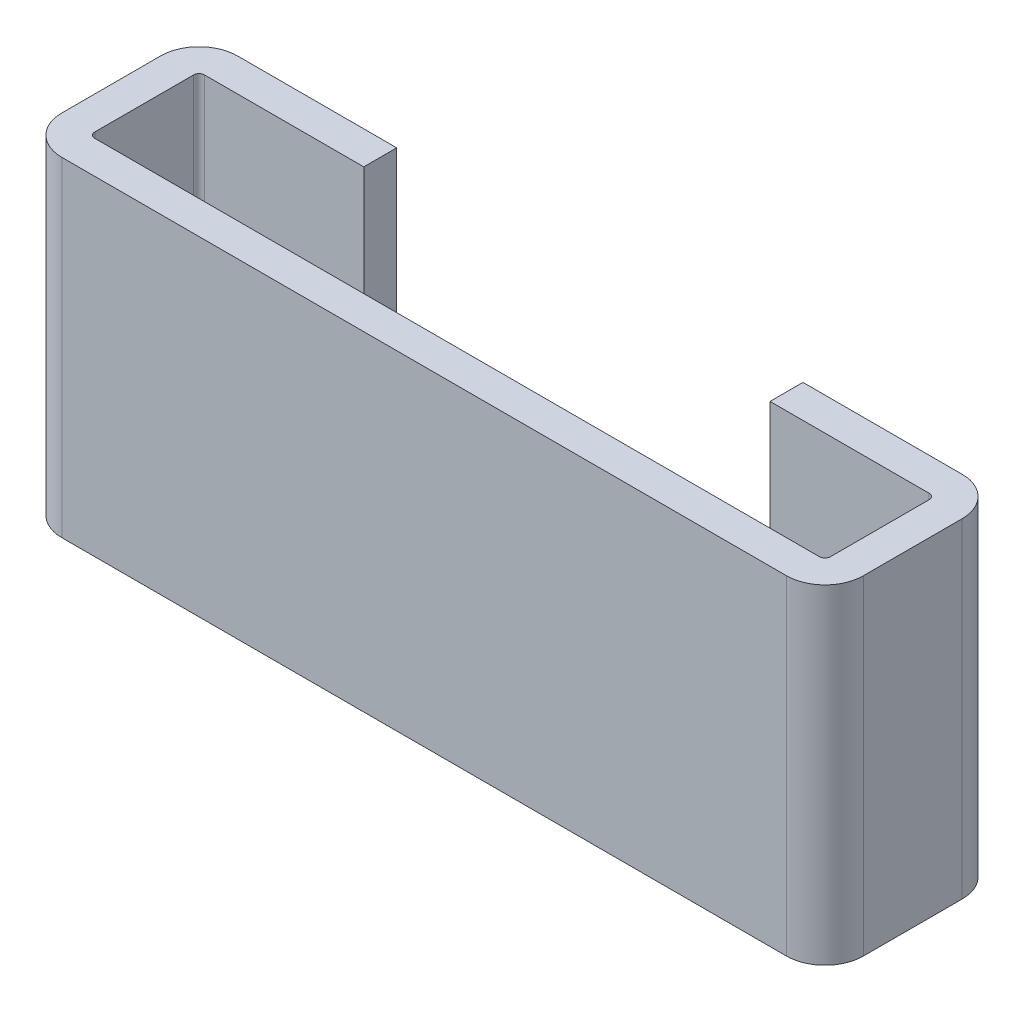
ISO-10303-21;
HEADER;
FILE_DESCRIPTION(('STEP AP214'),'2;1');
FILE_NAME('part.step','',(''),(''),'','','');
FILE_SCHEMA(('AUTOMOTIVE_DESIGN { 1 0 10303 214 1 1 1 1 }'));
ENDSEC;
DATA;
#1=APPLICATION_CONTEXT('core data for automotive mechanical design processes');
#2=APPLICATION_PROTOCOL_DEFINITION('international standard','automotive_design',2000,#1);
#3=PRODUCT_CONTEXT('',#1,'mechanical');
#4=PRODUCT('Part','Part','',(#3));
#5=PRODUCT_RELATED_PRODUCT_CATEGORY('part','',(#4));
#6=PRODUCT_DEFINITION_FORMATION('','',#4);
#7=PRODUCT_DEFINITION_CONTEXT('part definition',#1,'design');
#8=PRODUCT_DEFINITION('design','',#6,#7);
#9=PRODUCT_DEFINITION_SHAPE('','',#8);
#10=(LENGTH_UNIT() NAMED_UNIT(*) SI_UNIT(.MILLI.,.METRE.));
#11=(NAMED_UNIT(*) PLANE_ANGLE_UNIT() SI_UNIT($,.RADIAN.));
#12=(NAMED_UNIT(*) SI_UNIT($,.STERADIAN.) SOLID_ANGLE_UNIT());
#13=UNCERTAINTY_MEASURE_WITH_UNIT(LENGTH_MEASURE(1.E-05),#10,'distance_accuracy_value','');
#14=(GEOMETRIC_REPRESENTATION_CONTEXT(3) GLOBAL_UNCERTAINTY_ASSIGNED_CONTEXT((#13)) GLOBAL_UNIT_ASSIGNED_CONTEXT((#10,
#11,#12)) REPRESENTATION_CONTEXT('',''));
#15=CARTESIAN_POINT('',(0.,0.,0.));
#16=DIRECTION('',(0.,0.,1.));
#17=DIRECTION('',(1.,0.,0.));
#18=AXIS2_PLACEMENT_3D('',#15,#16,#17);
#19=CARTESIAN_POINT('',(1.85,1.5,-0.1));
#20=DIRECTION('',(1.,0.,0.));
#21=DIRECTION('',(0.,-1.,0.));
#22=AXIS2_PLACEMENT_3D('',#19,#20,#21);
#23=PLANE('',#22);
#24=DIRECTION('',(0.,1.,0.));
#25=VECTOR('',#24,1.);
#26=CARTESIAN_POINT('',(1.85,1.5,0.2));
#27=LINE('',#26,#25);
#28=CARTESIAN_POINT('',(1.85,-1.5,0.2));
#29=VERTEX_POINT('',#28);
#30=CARTESIAN_POINT('',(1.85,1.5,0.2));
#31=VERTEX_POINT('',#30);
#32=EDGE_CURVE('E11',#29,#31,#27,.T.);
#33=ORIENTED_EDGE('',*,*,#32,.T.);
#34=DIRECTION('',(0.,0.,-1.));
#35=VECTOR('',#34,1.);
#36=CARTESIAN_POINT('',(1.85,1.5,-0.1));
#37=LINE('',#36,#35);
#38=CARTESIAN_POINT('',(1.85,1.5,-0.1));
#39=VERTEX_POINT('',#38);
#40=EDGE_CURVE('E24',#31,#39,#37,.T.);
#41=ORIENTED_EDGE('',*,*,#40,.T.);
#42=DIRECTION('',(0.,-1.,0.));
#43=VECTOR('',#42,1.);
#44=CARTESIAN_POINT('',(1.85,1.5,-0.1));
#45=LINE('',#44,#43);
#46=CARTESIAN_POINT('',(1.85,-1.5,-0.1));
#47=VERTEX_POINT('',#46);
#48=EDGE_CURVE('E167',#39,#47,#45,.T.);
#49=ORIENTED_EDGE('',*,*,#48,.T.);
#50=DIRECTION('',(0.,0.,-1.));
#51=VECTOR('',#50,1.);
#52=CARTESIAN_POINT('',(1.85,-1.5,-0.1));
#53=LINE('',#52,#51);
#54=EDGE_CURVE('E267',#29,#47,#53,.T.);
#55=ORIENTED_EDGE('',*,*,#54,.F.);
#56=EDGE_LOOP('',(#33,#41,#49,#55));
#57=FACE_BOUND('',#56,.T.);
#58=ADVANCED_FACE('F17',(#57),#23,.F.);
#59=CARTESIAN_POINT('',(1.85,-1.5,-0.1));
#60=DIRECTION('',(0.,1.,0.));
#61=DIRECTION('',(1.,0.,0.));
#62=AXIS2_PLACEMENT_3D('',#59,#60,#61);
#63=PLANE('',#62);
#64=DIRECTION('',(1.,0.,0.));
#65=VECTOR('',#64,1.);
#66=CARTESIAN_POINT('',(1.85,-1.5,-0.1));
#67=LINE('',#66,#65);
#68=CARTESIAN_POINT('',(3.3,-1.5,-0.1));
#69=VERTEX_POINT('',#68);
#70=EDGE_CURVE('E265',#47,#69,#67,.T.);
#71=ORIENTED_EDGE('',*,*,#70,.T.);
#72=CARTESIAN_POINT('',(3.3,-1.5,0.25));
#73=DIRECTION('',(0.,-1.,0.));
#74=DIRECTION('',(-1.,0.,0.));
#75=AXIS2_PLACEMENT_3D('',#72,#73,#74);
#76=CIRCLE('',#75,0.35);
#77=CARTESIAN_POINT('',(3.65,-1.5,0.25));
#78=VERTEX_POINT('',#77);
#79=EDGE_CURVE('E172',#69,#78,#76,.T.);
#80=ORIENTED_EDGE('',*,*,#79,.T.);
#81=DIRECTION('',(0.,0.,1.));
#82=VECTOR('',#81,1.);
#83=CARTESIAN_POINT('',(3.65,-1.5,0.25));
#84=LINE('',#83,#82);
#85=CARTESIAN_POINT('',(3.65,-1.5,1.15));
#86=VERTEX_POINT('',#85);
#87=EDGE_CURVE('E262',#78,#86,#84,.T.);
#88=ORIENTED_EDGE('',*,*,#87,.T.);
#89=CARTESIAN_POINT('',(3.3,-1.5,1.15));
#90=DIRECTION('',(0.,-1.,0.));
#91=DIRECTION('',(0.,0.,-1.));
#92=AXIS2_PLACEMENT_3D('',#89,#90,#91);
#93=CIRCLE('',#92,0.35);
#94=CARTESIAN_POINT('',(3.3,-1.5,1.5));
#95=VERTEX_POINT('',#94);
#96=EDGE_CURVE('E260',#86,#95,#93,.T.);
#97=ORIENTED_EDGE('',*,*,#96,.T.);
#98=DIRECTION('',(-1.,0.,0.));
#99=VECTOR('',#98,1.);
#100=CARTESIAN_POINT('',(-3.3,-1.5,1.5));
#101=LINE('',#100,#99);
#102=CARTESIAN_POINT('',(-3.3,-1.5,1.5));
#103=VERTEX_POINT('',#102);
#104=EDGE_CURVE('E258',#95,#103,#101,.T.);
#105=ORIENTED_EDGE('',*,*,#104,.T.);
#106=CARTESIAN_POINT('',(-3.3,-1.5,1.15));
#107=DIRECTION('',(0.,-1.,0.));
#108=DIRECTION('',(0.,0.,-1.));
#109=AXIS2_PLACEMENT_3D('',#106,#107,#108);
#110=CIRCLE('',#109,0.35);
#111=CARTESIAN_POINT('',(-3.65,-1.5,1.15));
#112=VERTEX_POINT('',#111);
#113=EDGE_CURVE('E256',#103,#112,#110,.T.);
#114=ORIENTED_EDGE('',*,*,#113,.T.);
#115=DIRECTION('',(0.,0.,-1.));
#116=VECTOR('',#115,1.);
#117=CARTESIAN_POINT('',(-3.65,-1.5,1.15));
#118=LINE('',#117,#116);
#119=CARTESIAN_POINT('',(-3.65,-1.5,0.25));
#120=VERTEX_POINT('',#119);
#121=EDGE_CURVE('E254',#112,#120,#118,.T.);
#122=ORIENTED_EDGE('',*,*,#121,.T.);
#123=CARTESIAN_POINT('',(-3.3,-1.5,0.25));
#124=DIRECTION('',(0.,-1.,0.));
#125=DIRECTION('',(1.,0.,0.));
#126=AXIS2_PLACEMENT_3D('',#123,#124,#125);
#127=CIRCLE('',#126,0.35);
#128=CARTESIAN_POINT('',(-3.3,-1.5,-0.1));
#129=VERTEX_POINT('',#128);
#130=EDGE_CURVE('E252',#120,#129,#127,.T.);
#131=ORIENTED_EDGE('',*,*,#130,.T.);
#132=DIRECTION('',(1.,0.,0.));
#133=VECTOR('',#132,1.);
#134=CARTESIAN_POINT('',(-3.3,-1.5,-0.1));
#135=LINE('',#134,#133);
#136=CARTESIAN_POINT('',(-1.85,-1.5,-0.1));
#137=VERTEX_POINT('',#136);
#138=EDGE_CURVE('E250',#129,#137,#135,.T.);
#139=ORIENTED_EDGE('',*,*,#138,.T.);
#140=DIRECTION('',(0.,0.,-1.));
#141=VECTOR('',#140,1.);
#142=CARTESIAN_POINT('',(-1.85,-1.5,-0.1));
#143=LINE('',#142,#141);
#144=CARTESIAN_POINT('',(-1.85,-1.5,0.2));
#145=VERTEX_POINT('',#144);
#146=EDGE_CURVE('E247',#145,#137,#143,.T.);
#147=ORIENTED_EDGE('',*,*,#146,.F.);
#148=DIRECTION('',(-1.,0.,0.));
#149=VECTOR('',#148,1.);
#150=CARTESIAN_POINT('',(-3.3,-1.5,0.2));
#151=LINE('',#150,#149);
#152=CARTESIAN_POINT('',(-3.3,-1.5,0.2));
#153=VERTEX_POINT('',#152);
#154=EDGE_CURVE('E245',#145,#153,#151,.T.);
#155=ORIENTED_EDGE('',*,*,#154,.T.);
#156=CARTESIAN_POINT('',(-3.3,-1.5,0.25));
#157=DIRECTION('',(0.,-1.,0.));
#158=DIRECTION('',(1.,0.,0.));
#159=AXIS2_PLACEMENT_3D('',#156,#157,#158);
#160=CIRCLE('',#159,0.05);
#161=CARTESIAN_POINT('',(-3.35,-1.5,0.25));
#162=VERTEX_POINT('',#161);
#163=EDGE_CURVE('E242',#162,#153,#160,.T.);
#164=ORIENTED_EDGE('',*,*,#163,.F.);
#165=DIRECTION('',(0.,0.,1.));
#166=VECTOR('',#165,1.);
#167=CARTESIAN_POINT('',(-3.35,-1.5,1.15));
#168=LINE('',#167,#166);
#169=CARTESIAN_POINT('',(-3.35,-1.5,1.15));
#170=VERTEX_POINT('',#169);
#171=EDGE_CURVE('E240',#162,#170,#168,.T.);
#172=ORIENTED_EDGE('',*,*,#171,.T.);
#173=CARTESIAN_POINT('',(-3.3,-1.5,1.15));
#174=DIRECTION('',(0.,-1.,0.));
#175=DIRECTION('',(-1.,0.,0.));
#176=AXIS2_PLACEMENT_3D('',#173,#174,#175);
#177=CIRCLE('',#176,0.05);
#178=CARTESIAN_POINT('',(-3.3,-1.5,1.2));
#179=VERTEX_POINT('',#178);
#180=EDGE_CURVE('E237',#179,#170,#177,.T.);
#181=ORIENTED_EDGE('',*,*,#180,.F.);
#182=DIRECTION('',(1.,0.,0.));
#183=VECTOR('',#182,1.);
#184=CARTESIAN_POINT('',(-3.3,-1.5,1.2));
#185=LINE('',#184,#183);
#186=CARTESIAN_POINT('',(3.3,-1.5,1.2));
#187=VERTEX_POINT('',#186);
#188=EDGE_CURVE('E235',#179,#187,#185,.T.);
#189=ORIENTED_EDGE('',*,*,#188,.T.);
#190=CARTESIAN_POINT('',(3.3,-1.5,1.15));
#191=DIRECTION('',(0.,1.,0.));
#192=DIRECTION('',(0.,0.,1.));
#193=AXIS2_PLACEMENT_3D('',#190,#191,#192);
#194=CIRCLE('',#193,0.05);
#195=CARTESIAN_POINT('',(3.35,-1.5,1.15));
#196=VERTEX_POINT('',#195);
#197=EDGE_CURVE('E233',#187,#196,#194,.T.);
#198=ORIENTED_EDGE('',*,*,#197,.T.);
#199=DIRECTION('',(0.,0.,-1.));
#200=VECTOR('',#199,1.);
#201=CARTESIAN_POINT('',(3.35,-1.5,0.25));
#202=LINE('',#201,#200);
#203=CARTESIAN_POINT('',(3.35,-1.5,0.25));
#204=VERTEX_POINT('',#203);
#205=EDGE_CURVE('E231',#196,#204,#202,.T.);
#206=ORIENTED_EDGE('',*,*,#205,.T.);
#207=CARTESIAN_POINT('',(3.3,-1.5,0.25));
#208=DIRECTION('',(0.,1.,0.));
#209=DIRECTION('',(0.,0.,1.));
#210=AXIS2_PLACEMENT_3D('',#207,#208,#209);
#211=CIRCLE('',#210,0.05);
#212=CARTESIAN_POINT('',(3.3,-1.5,0.2));
#213=VERTEX_POINT('',#212);
#214=EDGE_CURVE('E229',#204,#213,#211,.T.);
#215=ORIENTED_EDGE('',*,*,#214,.T.);
#216=DIRECTION('',(-1.,0.,0.));
#217=VECTOR('',#216,1.);
#218=CARTESIAN_POINT('',(1.85,-1.5,0.2));
#219=LINE('',#218,#217);
#220=EDGE_CURVE('E226',#213,#29,#219,.T.);
#221=ORIENTED_EDGE('',*,*,#220,.T.);
#222=ORIENTED_EDGE('',*,*,#54,.T.);
#223=EDGE_LOOP('',(#71,#80,#88,#97,#105,#114,#122,#131,#139,#147,#155,#164,#172,#181,#189,#198,
#206,#215,#221,#222));
#224=FACE_BOUND('',#223,.T.);
#225=ADVANCED_FACE('F349',(#224),#63,.F.);
#226=CARTESIAN_POINT('',(-3.3,1.5,-0.1));
#227=DIRECTION('',(0.,1.,0.));
#228=DIRECTION('',(1.,0.,0.));
#229=AXIS2_PLACEMENT_3D('',#226,#227,#228);
#230=PLANE('',#229);
#231=DIRECTION('',(-1.,0.,0.));
#232=VECTOR('',#231,1.);
#233=CARTESIAN_POINT('',(1.85,1.5,0.2));
#234=LINE('',#233,#232);
#235=CARTESIAN_POINT('',(3.3,1.5,0.2));
#236=VERTEX_POINT('',#235);
#237=EDGE_CURVE('E224',#236,#31,#234,.T.);
#238=ORIENTED_EDGE('',*,*,#237,.F.);
#239=CARTESIAN_POINT('',(3.3,1.5,0.25));
#240=DIRECTION('',(0.,1.,0.));
#241=DIRECTION('',(0.,0.,1.));
#242=AXIS2_PLACEMENT_3D('',#239,#240,#241);
#243=CIRCLE('',#242,0.05);
#244=CARTESIAN_POINT('',(3.35,1.5,0.25));
#245=VERTEX_POINT('',#244);
#246=EDGE_CURVE('E221',#245,#236,#243,.T.);
#247=ORIENTED_EDGE('',*,*,#246,.F.);
#248=DIRECTION('',(0.,0.,-1.));
#249=VECTOR('',#248,1.);
#250=CARTESIAN_POINT('',(3.35,1.5,0.25));
#251=LINE('',#250,#249);
#252=CARTESIAN_POINT('',(3.35,1.5,1.15));
#253=VERTEX_POINT('',#252);
#254=EDGE_CURVE('E218',#253,#245,#251,.T.);
#255=ORIENTED_EDGE('',*,*,#254,.F.);
#256=CARTESIAN_POINT('',(3.3,1.5,1.15));
#257=DIRECTION('',(0.,1.,0.));
#258=DIRECTION('',(0.,0.,1.));
#259=AXIS2_PLACEMENT_3D('',#256,#257,#258);
#260=CIRCLE('',#259,0.05);
#261=CARTESIAN_POINT('',(3.3,1.5,1.2));
#262=VERTEX_POINT('',#261);
#263=EDGE_CURVE('E215',#262,#253,#260,.T.);
#264=ORIENTED_EDGE('',*,*,#263,.F.);
#265=DIRECTION('',(1.,0.,0.));
#266=VECTOR('',#265,1.);
#267=CARTESIAN_POINT('',(-3.3,1.5,1.2));
#268=LINE('',#267,#266);
#269=CARTESIAN_POINT('',(-3.3,1.5,1.2));
#270=VERTEX_POINT('',#269);
#271=EDGE_CURVE('E212',#270,#262,#268,.T.);
#272=ORIENTED_EDGE('',*,*,#271,.F.);
#273=CARTESIAN_POINT('',(-3.3,1.5,1.15));
#274=DIRECTION('',(0.,-1.,0.));
#275=DIRECTION('',(-1.,0.,0.));
#276=AXIS2_PLACEMENT_3D('',#273,#274,#275);
#277=CIRCLE('',#276,0.05);
#278=CARTESIAN_POINT('',(-3.35,1.5,1.15));
#279=VERTEX_POINT('',#278);
#280=EDGE_CURVE('E210',#270,#279,#277,.T.);
#281=ORIENTED_EDGE('',*,*,#280,.T.);
#282=DIRECTION('',(0.,0.,1.));
#283=VECTOR('',#282,1.);
#284=CARTESIAN_POINT('',(-3.35,1.5,1.15));
#285=LINE('',#284,#283);
#286=CARTESIAN_POINT('',(-3.35,1.5,0.25));
#287=VERTEX_POINT('',#286);
#288=EDGE_CURVE('E207',#287,#279,#285,.T.);
#289=ORIENTED_EDGE('',*,*,#288,.F.);
#290=CARTESIAN_POINT('',(-3.3,1.5,0.25));
#291=DIRECTION('',(0.,-1.,0.));
#292=DIRECTION('',(1.,0.,0.));
#293=AXIS2_PLACEMENT_3D('',#290,#291,#292);
#294=CIRCLE('',#293,0.05);
#295=CARTESIAN_POINT('',(-3.3,1.5,0.2));
#296=VERTEX_POINT('',#295);
#297=EDGE_CURVE('E205',#287,#296,#294,.T.);
#298=ORIENTED_EDGE('',*,*,#297,.T.);
#299=DIRECTION('',(-1.,0.,0.));
#300=VECTOR('',#299,1.);
#301=CARTESIAN_POINT('',(-3.3,1.5,0.2));
#302=LINE('',#301,#300);
#303=CARTESIAN_POINT('',(-1.85,1.5,0.2));
#304=VERTEX_POINT('',#303);
#305=EDGE_CURVE('E202',#304,#296,#302,.T.);
#306=ORIENTED_EDGE('',*,*,#305,.F.);
#307=DIRECTION('',(0.,0.,-1.));
#308=VECTOR('',#307,1.);
#309=CARTESIAN_POINT('',(-1.85,1.5,-0.1));
#310=LINE('',#309,#308);
#311=CARTESIAN_POINT('',(-1.85,1.5,-0.1));
#312=VERTEX_POINT('',#311);
#313=EDGE_CURVE('E200',#304,#312,#310,.T.);
#314=ORIENTED_EDGE('',*,*,#313,.T.);
#315=DIRECTION('',(1.,0.,0.));
#316=VECTOR('',#315,1.);
#317=CARTESIAN_POINT('',(-3.3,1.5,-0.1));
#318=LINE('',#317,#316);
#319=CARTESIAN_POINT('',(-3.3,1.5,-0.1));
#320=VERTEX_POINT('',#319);
#321=EDGE_CURVE('E197',#320,#312,#318,.T.);
#322=ORIENTED_EDGE('',*,*,#321,.F.);
#323=CARTESIAN_POINT('',(-3.3,1.5,0.25));
#324=DIRECTION('',(0.,1.,0.));
#325=DIRECTION('',(1.,0.,0.));
#326=AXIS2_PLACEMENT_3D('',#323,#324,#325);
#327=CIRCLE('',#326,0.35);
#328=CARTESIAN_POINT('',(-3.65,1.5,0.25));
#329=VERTEX_POINT('',#328);
#330=EDGE_CURVE('E195',#320,#329,#327,.T.);
#331=ORIENTED_EDGE('',*,*,#330,.T.);
#332=DIRECTION('',(0.,0.,-1.));
#333=VECTOR('',#332,1.);
#334=CARTESIAN_POINT('',(-3.65,1.5,1.15));
#335=LINE('',#334,#333);
#336=CARTESIAN_POINT('',(-3.65,1.5,1.15));
#337=VERTEX_POINT('',#336);
#338=EDGE_CURVE('E192',#337,#329,#335,.T.);
#339=ORIENTED_EDGE('',*,*,#338,.F.);
#340=CARTESIAN_POINT('',(-3.3,1.5,1.15));
#341=DIRECTION('',(0.,1.,0.));
#342=DIRECTION('',(0.,0.,-1.));
#343=AXIS2_PLACEMENT_3D('',#340,#341,#342);
#344=CIRCLE('',#343,0.35);
#345=CARTESIAN_POINT('',(-3.3,1.5,1.5));
#346=VERTEX_POINT('',#345);
#347=EDGE_CURVE('E190',#337,#346,#344,.T.);
#348=ORIENTED_EDGE('',*,*,#347,.T.);
#349=DIRECTION('',(-1.,0.,0.));
#350=VECTOR('',#349,1.);
#351=CARTESIAN_POINT('',(-3.3,1.5,1.5));
#352=LINE('',#351,#350);
#353=CARTESIAN_POINT('',(3.3,1.5,1.5));
#354=VERTEX_POINT('',#353);
#355=EDGE_CURVE('E187',#354,#346,#352,.T.);
#356=ORIENTED_EDGE('',*,*,#355,.F.);
#357=CARTESIAN_POINT('',(3.3,1.5,1.15));
#358=DIRECTION('',(0.,1.,0.));
#359=DIRECTION('',(0.,0.,-1.));
#360=AXIS2_PLACEMENT_3D('',#357,#358,#359);
#361=CIRCLE('',#360,0.35);
#362=CARTESIAN_POINT('',(3.65,1.5,1.15));
#363=VERTEX_POINT('',#362);
#364=EDGE_CURVE('E185',#354,#363,#361,.T.);
#365=ORIENTED_EDGE('',*,*,#364,.T.);
#366=DIRECTION('',(0.,0.,1.));
#367=VECTOR('',#366,1.);
#368=CARTESIAN_POINT('',(3.65,1.5,0.25));
#369=LINE('',#368,#367);
#370=CARTESIAN_POINT('',(3.65,1.5,0.25));
#371=VERTEX_POINT('',#370);
#372=EDGE_CURVE('E155',#371,#363,#369,.T.);
#373=ORIENTED_EDGE('',*,*,#372,.F.);
#374=CARTESIAN_POINT('',(3.3,1.5,0.25));
#375=DIRECTION('',(0.,1.,0.));
#376=DIRECTION('',(-1.,0.,0.));
#377=AXIS2_PLACEMENT_3D('',#374,#375,#376);
#378=CIRCLE('',#377,0.35);
#379=CARTESIAN_POINT('',(3.3,1.5,-0.1));
#380=VERTEX_POINT('',#379);
#381=EDGE_CURVE('E150',#371,#380,#378,.T.);
#382=ORIENTED_EDGE('',*,*,#381,.T.);
#383=DIRECTION('',(1.,0.,0.));
#384=VECTOR('',#383,1.);
#385=CARTESIAN_POINT('',(1.85,1.5,-0.1));
#386=LINE('',#385,#384);
#387=EDGE_CURVE('E153',#39,#380,#386,.T.);
#388=ORIENTED_EDGE('',*,*,#387,.F.);
#389=ORIENTED_EDGE('',*,*,#40,.F.);
#390=EDGE_LOOP('',(#238,#247,#255,#264,#272,#281,#289,#298,#306,#314,#322,#331,#339,#348,#356,
#365,#373,#382,#388,#389));
#391=FACE_BOUND('',#390,.T.);
#392=ADVANCED_FACE('F152',(#391),#230,.T.);
#393=CARTESIAN_POINT('',(3.65,1.5,0.25));
#394=DIRECTION('',(1.,0.,0.));
#395=DIRECTION('',(0.,0.,-1.));
#396=AXIS2_PLACEMENT_3D('',#393,#394,#395);
#397=PLANE('',#396);
#398=ORIENTED_EDGE('',*,*,#87,.F.);
#399=DIRECTION('',(0.,-1.,0.));
#400=VECTOR('',#399,1.);
#401=CARTESIAN_POINT('',(3.65,1.5,0.25));
#402=LINE('',#401,#400);
#403=EDGE_CURVE('E168',#371,#78,#402,.T.);
#404=ORIENTED_EDGE('',*,*,#403,.F.);
#405=ORIENTED_EDGE('',*,*,#372,.T.);
#406=DIRECTION('',(0.,-1.,0.));
#407=VECTOR('',#406,1.);
#408=CARTESIAN_POINT('',(3.65,1.5,1.15));
#409=LINE('',#408,#407);
#410=EDGE_CURVE('E173',#363,#86,#409,.T.);
#411=ORIENTED_EDGE('',*,*,#410,.T.);
#412=EDGE_LOOP('',(#398,#404,#405,#411));
#413=FACE_BOUND('',#412,.T.);
#414=ADVANCED_FACE('F389',(#413),#397,.T.);
#415=CARTESIAN_POINT('',(3.3,-1.5,0.25));
#416=DIRECTION('',(0.,-1.,0.));
#417=DIRECTION('',(-1.,0.,0.));
#418=AXIS2_PLACEMENT_3D('',#415,#416,#417);
#419=CYLINDRICAL_SURFACE('',#418,0.35);
#420=ORIENTED_EDGE('',*,*,#381,.F.);
#421=ORIENTED_EDGE('',*,*,#403,.T.);
#422=ORIENTED_EDGE('',*,*,#79,.F.);
#423=DIRECTION('',(0.,-1.,0.));
#424=VECTOR('',#423,1.);
#425=CARTESIAN_POINT('',(3.3,1.5,-0.1));
#426=LINE('',#425,#424);
#427=EDGE_CURVE('E166',#380,#69,#426,.T.);
#428=ORIENTED_EDGE('',*,*,#427,.F.);
#429=EDGE_LOOP('',(#420,#421,#422,#428));
#430=FACE_BOUND('',#429,.T.);
#431=ADVANCED_FACE('F171',(#430),#419,.T.);
#432=CARTESIAN_POINT('',(1.85,1.5,-0.1));
#433=DIRECTION('',(0.,0.,-1.));
#434=DIRECTION('',(-1.,0.,0.));
#435=AXIS2_PLACEMENT_3D('',#432,#433,#434);
#436=PLANE('',#435);
#437=ORIENTED_EDGE('',*,*,#70,.F.);
#438=ORIENTED_EDGE('',*,*,#48,.F.);
#439=ORIENTED_EDGE('',*,*,#387,.T.);
#440=ORIENTED_EDGE('',*,*,#427,.T.);
#441=EDGE_LOOP('',(#437,#438,#439,#440));
#442=FACE_BOUND('',#441,.T.);
#443=ADVANCED_FACE('F165',(#442),#436,.T.);
#444=CARTESIAN_POINT('',(1.85,1.5,0.2));
#445=DIRECTION('',(0.,0.,-1.));
#446=DIRECTION('',(-1.,0.,0.));
#447=AXIS2_PLACEMENT_3D('',#444,#445,#446);
#448=PLANE('',#447);
#449=ORIENTED_EDGE('',*,*,#220,.F.);
#450=DIRECTION('',(0.,1.,0.));
#451=VECTOR('',#450,1.);
#452=CARTESIAN_POINT('',(3.3,1.5,0.2));
#453=LINE('',#452,#451);
#454=EDGE_CURVE('E174',#213,#236,#453,.T.);
#455=ORIENTED_EDGE('',*,*,#454,.T.);
#456=ORIENTED_EDGE('',*,*,#237,.T.);
#457=ORIENTED_EDGE('',*,*,#32,.F.);
#458=EDGE_LOOP('',(#449,#455,#456,#457));
#459=FACE_BOUND('',#458,.T.);
#460=ADVANCED_FACE('F270',(#459),#448,.F.);
#461=CARTESIAN_POINT('',(3.3,-1.5,0.25));
#462=DIRECTION('',(0.,-1.,0.));
#463=DIRECTION('',(-1.,0.,0.));
#464=AXIS2_PLACEMENT_3D('',#461,#462,#463);
#465=CYLINDRICAL_SURFACE('',#464,0.05);
#466=ORIENTED_EDGE('',*,*,#246,.T.);
#467=ORIENTED_EDGE('',*,*,#454,.F.);
#468=ORIENTED_EDGE('',*,*,#214,.F.);
#469=DIRECTION('',(0.,-1.,0.));
#470=VECTOR('',#469,1.);
#471=CARTESIAN_POINT('',(3.35,1.5,0.25));
#472=LINE('',#471,#470);
#473=EDGE_CURVE('E179',#245,#204,#472,.T.);
#474=ORIENTED_EDGE('',*,*,#473,.F.);
#475=EDGE_LOOP('',(#466,#467,#468,#474));
#476=FACE_BOUND('',#475,.T.);
#477=ADVANCED_FACE('F274',(#476),#465,.F.);
#478=CARTESIAN_POINT('',(-3.3,1.5,1.2));
#479=DIRECTION('',(0.,0.,1.));
#480=DIRECTION('',(1.,0.,0.));
#481=AXIS2_PLACEMENT_3D('',#478,#479,#480);
#482=PLANE('',#481);
#483=ORIENTED_EDGE('',*,*,#188,.F.);
#484=DIRECTION('',(0.,1.,0.));
#485=VECTOR('',#484,1.);
#486=CARTESIAN_POINT('',(-3.3,1.5,1.2));
#487=LINE('',#486,#485);
#488=EDGE_CURVE('E289',#179,#270,#487,.T.);
#489=ORIENTED_EDGE('',*,*,#488,.T.);
#490=ORIENTED_EDGE('',*,*,#271,.T.);
#491=DIRECTION('',(0.,-1.,0.));
#492=VECTOR('',#491,1.);
#493=CARTESIAN_POINT('',(3.3,1.5,1.2));
#494=LINE('',#493,#492);
#495=EDGE_CURVE('E285',#262,#187,#494,.T.);
#496=ORIENTED_EDGE('',*,*,#495,.T.);
#497=EDGE_LOOP('',(#483,#489,#490,#496));
#498=FACE_BOUND('',#497,.T.);
#499=ADVANCED_FACE('F300',(#498),#482,.F.);
#500=CARTESIAN_POINT('',(3.3,-1.5,1.15));
#501=DIRECTION('',(0.,-1.,0.));
#502=DIRECTION('',(0.,0.,-1.));
#503=AXIS2_PLACEMENT_3D('',#500,#501,#502);
#504=CYLINDRICAL_SURFACE('',#503,0.05);
#505=ORIENTED_EDGE('',*,*,#263,.T.);
#506=DIRECTION('',(0.,1.,0.));
#507=VECTOR('',#506,1.);
#508=CARTESIAN_POINT('',(3.35,1.5,1.15));
#509=LINE('',#508,#507);
#510=EDGE_CURVE('E282',#196,#253,#509,.T.);
#511=ORIENTED_EDGE('',*,*,#510,.F.);
#512=ORIENTED_EDGE('',*,*,#197,.F.);
#513=ORIENTED_EDGE('',*,*,#495,.F.);
#514=EDGE_LOOP('',(#505,#511,#512,#513));
#515=FACE_BOUND('',#514,.T.);
#516=ADVANCED_FACE('F371',(#515),#504,.F.);
#517=CARTESIAN_POINT('',(3.35,1.5,0.25));
#518=DIRECTION('',(1.,0.,0.));
#519=DIRECTION('',(0.,0.,-1.));
#520=AXIS2_PLACEMENT_3D('',#517,#518,#519);
#521=PLANE('',#520);
#522=ORIENTED_EDGE('',*,*,#205,.F.);
#523=ORIENTED_EDGE('',*,*,#510,.T.);
#524=ORIENTED_EDGE('',*,*,#254,.T.);
#525=ORIENTED_EDGE('',*,*,#473,.T.);
#526=EDGE_LOOP('',(#522,#523,#524,#525));
#527=FACE_BOUND('',#526,.T.);
#528=ADVANCED_FACE('F280',(#527),#521,.F.);
#529=CARTESIAN_POINT('',(3.3,-1.5,1.15));
#530=DIRECTION('',(0.,-1.,0.));
#531=DIRECTION('',(0.,0.,-1.));
#532=AXIS2_PLACEMENT_3D('',#529,#530,#531);
#533=CYLINDRICAL_SURFACE('',#532,0.35);
#534=ORIENTED_EDGE('',*,*,#364,.F.);
#535=DIRECTION('',(0.,-1.,0.));
#536=VECTOR('',#535,1.);
#537=CARTESIAN_POINT('',(3.3,1.5,1.5));
#538=LINE('',#537,#536);
#539=EDGE_CURVE('E286',#354,#95,#538,.T.);
#540=ORIENTED_EDGE('',*,*,#539,.T.);
#541=ORIENTED_EDGE('',*,*,#96,.F.);
#542=ORIENTED_EDGE('',*,*,#410,.F.);
#543=EDGE_LOOP('',(#534,#540,#541,#542));
#544=FACE_BOUND('',#543,.T.);
#545=ADVANCED_FACE('F379',(#544),#533,.T.);
#546=CARTESIAN_POINT('',(-3.3,1.5,1.15));
#547=DIRECTION('',(0.,1.,0.));
#548=DIRECTION('',(0.,0.,-1.));
#549=AXIS2_PLACEMENT_3D('',#546,#547,#548);
#550=CYLINDRICAL_SURFACE('',#549,0.05);
#551=ORIENTED_EDGE('',*,*,#280,.F.);
#552=ORIENTED_EDGE('',*,*,#488,.F.);
#553=ORIENTED_EDGE('',*,*,#180,.T.);
#554=DIRECTION('',(0.,-1.,0.));
#555=VECTOR('',#554,1.);
#556=CARTESIAN_POINT('',(-3.35,1.5,1.15));
#557=LINE('',#556,#555);
#558=EDGE_CURVE('E292',#279,#170,#557,.T.);
#559=ORIENTED_EDGE('',*,*,#558,.F.);
#560=EDGE_LOOP('',(#551,#552,#553,#559));
#561=FACE_BOUND('',#560,.T.);
#562=ADVANCED_FACE('F304',(#561),#550,.F.);
#563=CARTESIAN_POINT('',(-3.35,1.5,1.15));
#564=DIRECTION('',(-1.,0.,0.));
#565=DIRECTION('',(0.,0.,1.));
#566=AXIS2_PLACEMENT_3D('',#563,#564,#565);
#567=PLANE('',#566);
#568=ORIENTED_EDGE('',*,*,#171,.F.);
#569=DIRECTION('',(0.,1.,0.));
#570=VECTOR('',#569,1.);
#571=CARTESIAN_POINT('',(-3.35,1.5,0.25));
#572=LINE('',#571,#570);
#573=EDGE_CURVE('E313',#162,#287,#572,.T.);
#574=ORIENTED_EDGE('',*,*,#573,.T.);
#575=ORIENTED_EDGE('',*,*,#288,.T.);
#576=ORIENTED_EDGE('',*,*,#558,.T.);
#577=EDGE_LOOP('',(#568,#574,#575,#576));
#578=FACE_BOUND('',#577,.T.);
#579=ADVANCED_FACE('F311',(#578),#567,.F.);
#580=CARTESIAN_POINT('',(-3.3,1.5,0.25));
#581=DIRECTION('',(0.,1.,0.));
#582=DIRECTION('',(1.,0.,0.));
#583=AXIS2_PLACEMENT_3D('',#580,#581,#582);
#584=CYLINDRICAL_SURFACE('',#583,0.05);
#585=ORIENTED_EDGE('',*,*,#297,.F.);
#586=ORIENTED_EDGE('',*,*,#573,.F.);
#587=ORIENTED_EDGE('',*,*,#163,.T.);
#588=DIRECTION('',(0.,-1.,0.));
#589=VECTOR('',#588,1.);
#590=CARTESIAN_POINT('',(-3.3,1.5,0.2));
#591=LINE('',#590,#589);
#592=EDGE_CURVE('E315',#296,#153,#591,.T.);
#593=ORIENTED_EDGE('',*,*,#592,.F.);
#594=EDGE_LOOP('',(#585,#586,#587,#593));
#595=FACE_BOUND('',#594,.T.);
#596=ADVANCED_FACE('F370',(#595),#584,.F.);
#597=CARTESIAN_POINT('',(-3.3,1.5,0.2));
#598=DIRECTION('',(0.,0.,-1.));
#599=DIRECTION('',(-1.,0.,0.));
#600=AXIS2_PLACEMENT_3D('',#597,#598,#599);
#601=PLANE('',#600);
#602=ORIENTED_EDGE('',*,*,#154,.F.);
#603=DIRECTION('',(0.,1.,0.));
#604=VECTOR('',#603,1.);
#605=CARTESIAN_POINT('',(-1.85,1.5,0.2));
#606=LINE('',#605,#604);
#607=EDGE_CURVE('E318',#145,#304,#606,.T.);
#608=ORIENTED_EDGE('',*,*,#607,.T.);
#609=ORIENTED_EDGE('',*,*,#305,.T.);
#610=ORIENTED_EDGE('',*,*,#592,.T.);
#611=EDGE_LOOP('',(#602,#608,#609,#610));
#612=FACE_BOUND('',#611,.T.);
#613=ADVANCED_FACE('F368',(#612),#601,.F.);
#614=CARTESIAN_POINT('',(-1.85,1.5,-0.1));
#615=DIRECTION('',(1.,0.,0.));
#616=DIRECTION('',(0.,-1.,0.));
#617=AXIS2_PLACEMENT_3D('',#614,#615,#616);
#618=PLANE('',#617);
#619=ORIENTED_EDGE('',*,*,#313,.F.);
#620=ORIENTED_EDGE('',*,*,#607,.F.);
#621=ORIENTED_EDGE('',*,*,#146,.T.);
#622=DIRECTION('',(0.,-1.,0.));
#623=VECTOR('',#622,1.);
#624=CARTESIAN_POINT('',(-1.85,1.5,-0.1));
#625=LINE('',#624,#623);
#626=EDGE_CURVE('E323',#312,#137,#625,.T.);
#627=ORIENTED_EDGE('',*,*,#626,.F.);
#628=EDGE_LOOP('',(#619,#620,#621,#627));
#629=FACE_BOUND('',#628,.T.);
#630=ADVANCED_FACE('F364',(#629),#618,.T.);
#631=CARTESIAN_POINT('',(-3.3,1.5,-0.1));
#632=DIRECTION('',(0.,0.,-1.));
#633=DIRECTION('',(-1.,0.,0.));
#634=AXIS2_PLACEMENT_3D('',#631,#632,#633);
#635=PLANE('',#634);
#636=ORIENTED_EDGE('',*,*,#138,.F.);
#637=DIRECTION('',(0.,-1.,0.));
#638=VECTOR('',#637,1.);
#639=CARTESIAN_POINT('',(-3.3,1.5,-0.1));
#640=LINE('',#639,#638);
#641=EDGE_CURVE('E326',#320,#129,#640,.T.);
#642=ORIENTED_EDGE('',*,*,#641,.F.);
#643=ORIENTED_EDGE('',*,*,#321,.T.);
#644=ORIENTED_EDGE('',*,*,#626,.T.);
#645=EDGE_LOOP('',(#636,#642,#643,#644));
#646=FACE_BOUND('',#645,.T.);
#647=ADVANCED_FACE('F360',(#646),#635,.T.);
#648=CARTESIAN_POINT('',(-3.3,1.5,0.25));
#649=DIRECTION('',(0.,1.,0.));
#650=DIRECTION('',(1.,0.,0.));
#651=AXIS2_PLACEMENT_3D('',#648,#649,#650);
#652=CYLINDRICAL_SURFACE('',#651,0.35);
#653=ORIENTED_EDGE('',*,*,#330,.F.);
#654=ORIENTED_EDGE('',*,*,#641,.T.);
#655=ORIENTED_EDGE('',*,*,#130,.F.);
#656=DIRECTION('',(0.,-1.,0.));
#657=VECTOR('',#656,1.);
#658=CARTESIAN_POINT('',(-3.65,1.5,0.25));
#659=LINE('',#658,#657);
#660=EDGE_CURVE('E329',#329,#120,#659,.T.);
#661=ORIENTED_EDGE('',*,*,#660,.F.);
#662=EDGE_LOOP('',(#653,#654,#655,#661));
#663=FACE_BOUND('',#662,.T.);
#664=ADVANCED_FACE('F356',(#663),#652,.T.);
#665=CARTESIAN_POINT('',(-3.65,1.5,1.15));
#666=DIRECTION('',(-1.,0.,0.));
#667=DIRECTION('',(0.,0.,1.));
#668=AXIS2_PLACEMENT_3D('',#665,#666,#667);
#669=PLANE('',#668);
#670=ORIENTED_EDGE('',*,*,#121,.F.);
#671=DIRECTION('',(0.,-1.,0.));
#672=VECTOR('',#671,1.);
#673=CARTESIAN_POINT('',(-3.65,1.5,1.15));
#674=LINE('',#673,#672);
#675=EDGE_CURVE('E332',#337,#112,#674,.T.);
#676=ORIENTED_EDGE('',*,*,#675,.F.);
#677=ORIENTED_EDGE('',*,*,#338,.T.);
#678=ORIENTED_EDGE('',*,*,#660,.T.);
#679=EDGE_LOOP('',(#670,#676,#677,#678));
#680=FACE_BOUND('',#679,.T.);
#681=ADVANCED_FACE('F352',(#680),#669,.T.);
#682=CARTESIAN_POINT('',(-3.3,1.5,1.15));
#683=DIRECTION('',(0.,1.,0.));
#684=DIRECTION('',(0.,0.,-1.));
#685=AXIS2_PLACEMENT_3D('',#682,#683,#684);
#686=CYLINDRICAL_SURFACE('',#685,0.35);
#687=ORIENTED_EDGE('',*,*,#347,.F.);
#688=ORIENTED_EDGE('',*,*,#675,.T.);
#689=ORIENTED_EDGE('',*,*,#113,.F.);
#690=DIRECTION('',(0.,-1.,0.));
#691=VECTOR('',#690,1.);
#692=CARTESIAN_POINT('',(-3.3,1.5,1.5));
#693=LINE('',#692,#691);
#694=EDGE_CURVE('E335',#346,#103,#693,.T.);
#695=ORIENTED_EDGE('',*,*,#694,.F.);
#696=EDGE_LOOP('',(#687,#688,#689,#695));
#697=FACE_BOUND('',#696,.T.);
#698=ADVANCED_FACE('F345',(#697),#686,.T.);
#699=CARTESIAN_POINT('',(-3.3,1.5,1.5));
#700=DIRECTION('',(0.,0.,1.));
#701=DIRECTION('',(1.,0.,0.));
#702=AXIS2_PLACEMENT_3D('',#699,#700,#701);
#703=PLANE('',#702);
#704=ORIENTED_EDGE('',*,*,#104,.F.);
#705=ORIENTED_EDGE('',*,*,#539,.F.);
#706=ORIENTED_EDGE('',*,*,#355,.T.);
#707=ORIENTED_EDGE('',*,*,#694,.T.);
#708=EDGE_LOOP('',(#704,#705,#706,#707));
#709=FACE_BOUND('',#708,.T.);
#710=ADVANCED_FACE('F340',(#709),#703,.T.);
#711=CLOSED_SHELL('',(#58,#225,#392,#414,#431,#443,#460,#477,#499,#516,#528,#545,#562,#579,#596,
#613,#630,#647,#664,#681,#698,#710));
#712=MANIFOLD_SOLID_BREP('B1',#711);
#713=ADVANCED_BREP_SHAPE_REPRESENTATION('',(#18,#712),#14);
#714=SHAPE_DEFINITION_REPRESENTATION(#9,#713);
ENDSEC;
END-ISO-10303-21;
